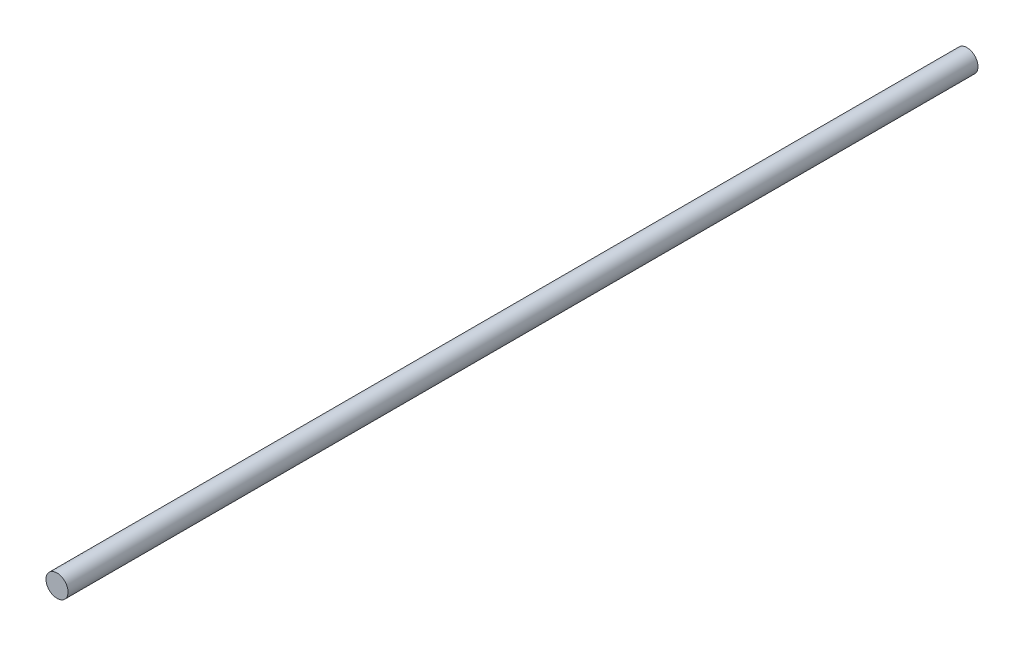
ISO-10303-21;
HEADER;
FILE_DESCRIPTION(('STEP AP214'),'2;1');
FILE_NAME('part.step','',(''),(''),'','','');
FILE_SCHEMA(('AUTOMOTIVE_DESIGN { 1 0 10303 214 1 1 1 1 }'));
ENDSEC;
DATA;
#1=APPLICATION_CONTEXT('core data for automotive mechanical design processes');
#2=APPLICATION_PROTOCOL_DEFINITION('international standard','automotive_design',2000,#1);
#3=PRODUCT_CONTEXT('',#1,'mechanical');
#4=PRODUCT('Part','Part','',(#3));
#5=PRODUCT_RELATED_PRODUCT_CATEGORY('part','',(#4));
#6=PRODUCT_DEFINITION_FORMATION('','',#4);
#7=PRODUCT_DEFINITION_CONTEXT('part definition',#1,'design');
#8=PRODUCT_DEFINITION('design','',#6,#7);
#9=PRODUCT_DEFINITION_SHAPE('','',#8);
#10=(LENGTH_UNIT() NAMED_UNIT(*) SI_UNIT(.MILLI.,.METRE.));
#11=(NAMED_UNIT(*) PLANE_ANGLE_UNIT() SI_UNIT($,.RADIAN.));
#12=(NAMED_UNIT(*) SI_UNIT($,.STERADIAN.) SOLID_ANGLE_UNIT());
#13=UNCERTAINTY_MEASURE_WITH_UNIT(LENGTH_MEASURE(1.E-05),#10,'distance_accuracy_value','');
#14=(GEOMETRIC_REPRESENTATION_CONTEXT(3) GLOBAL_UNCERTAINTY_ASSIGNED_CONTEXT((#13)) GLOBAL_UNIT_ASSIGNED_CONTEXT((#10,
#11,#12)) REPRESENTATION_CONTEXT('',''));
#15=CARTESIAN_POINT('',(0.,0.,0.));
#16=DIRECTION('',(0.,0.,1.));
#17=DIRECTION('',(1.,0.,0.));
#18=AXIS2_PLACEMENT_3D('',#15,#16,#17);
#19=CARTESIAN_POINT('',(0.,0.,330.));
#20=DIRECTION('',(0.,0.,-1.));
#21=DIRECTION('',(-1.,0.,0.));
#22=AXIS2_PLACEMENT_3D('',#19,#20,#21);
#23=CYLINDRICAL_SURFACE('',#22,4.);
#24=CARTESIAN_POINT('',(0.,0.,330.));
#25=DIRECTION('',(0.,0.,1.));
#26=DIRECTION('',(1.,0.,0.));
#27=AXIS2_PLACEMENT_3D('',#24,#25,#26);
#28=CIRCLE('',#27,4.);
#29=CARTESIAN_POINT('',(4.,0.,330.));
#30=VERTEX_POINT('',#29);
#31=EDGE_CURVE('E10',#30,#30,#28,.T.);
#32=ORIENTED_EDGE('',*,*,#31,.F.);
#33=EDGE_LOOP('',(#32));
#34=FACE_BOUND('',#33,.T.);
#35=CARTESIAN_POINT('',(0.,0.,0.));
#36=DIRECTION('',(0.,0.,1.));
#37=DIRECTION('',(1.,0.,0.));
#38=AXIS2_PLACEMENT_3D('',#35,#36,#37);
#39=CIRCLE('',#38,4.);
#40=CARTESIAN_POINT('',(4.,0.,0.));
#41=VERTEX_POINT('',#40);
#42=EDGE_CURVE('E35',#41,#41,#39,.T.);
#43=ORIENTED_EDGE('',*,*,#42,.T.);
#44=EDGE_LOOP('',(#43));
#45=FACE_BOUND('',#44,.T.);
#46=ADVANCED_FACE('F32',(#34,#45),#23,.T.);
#47=CARTESIAN_POINT('',(0.,0.,330.));
#48=DIRECTION('',(0.,0.,1.));
#49=DIRECTION('',(1.,0.,0.));
#50=AXIS2_PLACEMENT_3D('',#47,#48,#49);
#51=PLANE('',#50);
#52=ORIENTED_EDGE('',*,*,#31,.T.);
#53=EDGE_LOOP('',(#52));
#54=FACE_BOUND('',#53,.T.);
#55=ADVANCED_FACE('F47',(#54),#51,.T.);
#56=CARTESIAN_POINT('',(0.,0.,0.));
#57=DIRECTION('',(0.,0.,1.));
#58=DIRECTION('',(1.,0.,0.));
#59=AXIS2_PLACEMENT_3D('',#56,#57,#58);
#60=PLANE('',#59);
#61=ORIENTED_EDGE('',*,*,#42,.F.);
#62=EDGE_LOOP('',(#61));
#63=FACE_BOUND('',#62,.T.);
#64=ADVANCED_FACE('F45',(#63),#60,.F.);
#65=CLOSED_SHELL('',(#46,#55,#64));
#66=MANIFOLD_SOLID_BREP('B2',#65);
#67=ADVANCED_BREP_SHAPE_REPRESENTATION('',(#18,#66),#14);
#68=SHAPE_DEFINITION_REPRESENTATION(#9,#67);
ENDSEC;
END-ISO-10303-21;
